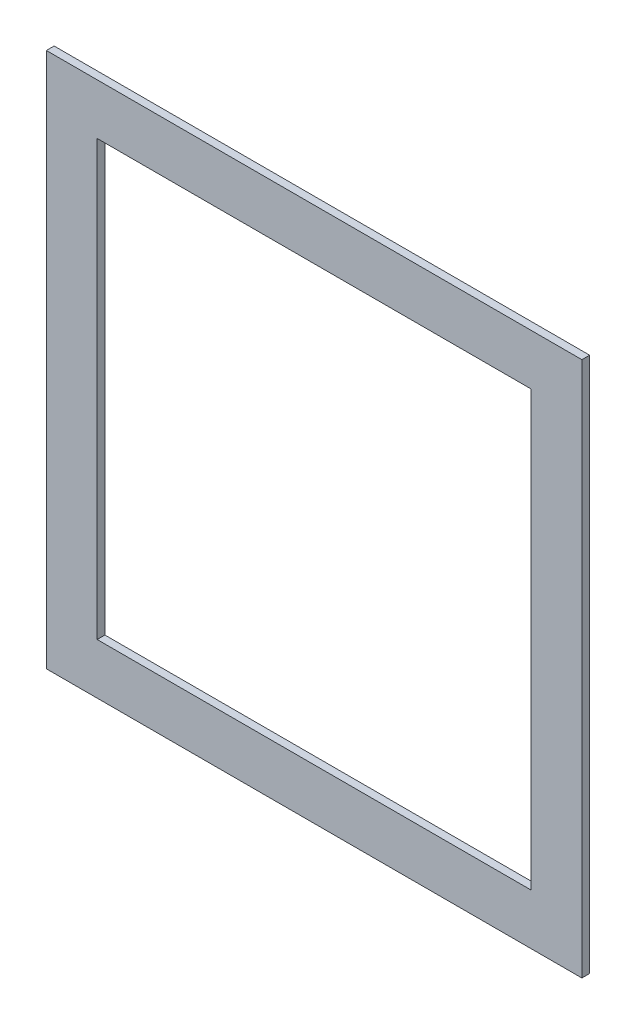
ISO-10303-21;
HEADER;
FILE_DESCRIPTION(('STEP AP214'),'2;1');
FILE_NAME('part.step','',(''),(''),'','','');
FILE_SCHEMA(('AUTOMOTIVE_DESIGN { 1 0 10303 214 1 1 1 1 }'));
ENDSEC;
DATA;
#1=APPLICATION_CONTEXT('core data for automotive mechanical design processes');
#2=APPLICATION_PROTOCOL_DEFINITION('international standard','automotive_design',2000,#1);
#3=PRODUCT_CONTEXT('',#1,'mechanical');
#4=PRODUCT('Part','Part','',(#3));
#5=PRODUCT_RELATED_PRODUCT_CATEGORY('part','',(#4));
#6=PRODUCT_DEFINITION_FORMATION('','',#4);
#7=PRODUCT_DEFINITION_CONTEXT('part definition',#1,'design');
#8=PRODUCT_DEFINITION('design','',#6,#7);
#9=PRODUCT_DEFINITION_SHAPE('','',#8);
#10=(LENGTH_UNIT() NAMED_UNIT(*) SI_UNIT(.MILLI.,.METRE.));
#11=(NAMED_UNIT(*) PLANE_ANGLE_UNIT() SI_UNIT($,.RADIAN.));
#12=(NAMED_UNIT(*) SI_UNIT($,.STERADIAN.) SOLID_ANGLE_UNIT());
#13=UNCERTAINTY_MEASURE_WITH_UNIT(LENGTH_MEASURE(1.E-05),#10,'distance_accuracy_value','');
#14=(GEOMETRIC_REPRESENTATION_CONTEXT(3) GLOBAL_UNCERTAINTY_ASSIGNED_CONTEXT((#13)) GLOBAL_UNIT_ASSIGNED_CONTEXT((#10,
#11,#12)) REPRESENTATION_CONTEXT('',''));
#15=CARTESIAN_POINT('',(0.,0.,0.));
#16=DIRECTION('',(0.,0.,1.));
#17=DIRECTION('',(1.,0.,0.));
#18=AXIS2_PLACEMENT_3D('',#15,#16,#17);
#19=CARTESIAN_POINT('',(0.,0.,5.334));
#20=DIRECTION('',(0.,0.,-1.));
#21=DIRECTION('',(-1.,0.,0.));
#22=AXIS2_PLACEMENT_3D('',#19,#20,#21);
#23=PLANE('',#22);
#24=DIRECTION('',(0.,1.,0.));
#25=VECTOR('',#24,1.);
#26=CARTESIAN_POINT('',(184.15,-184.15,5.334));
#27=LINE('',#26,#25);
#28=CARTESIAN_POINT('',(184.15,-184.15,5.334));
#29=VERTEX_POINT('',#28);
#30=CARTESIAN_POINT('',(184.15,184.15,5.334));
#31=VERTEX_POINT('',#30);
#32=EDGE_CURVE('E153',#29,#31,#27,.T.);
#33=ORIENTED_EDGE('',*,*,#32,.T.);
#34=DIRECTION('',(-1.,0.,0.));
#35=VECTOR('',#34,1.);
#36=CARTESIAN_POINT('',(-184.15,184.15,5.334));
#37=LINE('',#36,#35);
#38=CARTESIAN_POINT('',(-184.15,184.15,5.334));
#39=VERTEX_POINT('',#38);
#40=EDGE_CURVE('E157',#31,#39,#37,.T.);
#41=ORIENTED_EDGE('',*,*,#40,.T.);
#42=DIRECTION('',(0.,-1.,0.));
#43=VECTOR('',#42,1.);
#44=CARTESIAN_POINT('',(-184.15,-184.15,5.334));
#45=LINE('',#44,#43);
#46=CARTESIAN_POINT('',(-184.15,-184.15,5.334));
#47=VERTEX_POINT('',#46);
#48=EDGE_CURVE('E161',#39,#47,#45,.T.);
#49=ORIENTED_EDGE('',*,*,#48,.T.);
#50=DIRECTION('',(1.,0.,0.));
#51=VECTOR('',#50,1.);
#52=CARTESIAN_POINT('',(-184.15,-184.15,5.334));
#53=LINE('',#52,#51);
#54=EDGE_CURVE('E164',#47,#29,#53,.T.);
#55=ORIENTED_EDGE('',*,*,#54,.T.);
#56=EDGE_LOOP('',(#33,#41,#49,#55));
#57=FACE_BOUND('',#56,.T.);
#58=DIRECTION('',(0.,-1.,0.));
#59=VECTOR('',#58,1.);
#60=CARTESIAN_POINT('',(-149.225,149.225,5.334));
#61=LINE('',#60,#59);
#62=CARTESIAN_POINT('',(-149.225,149.225,5.334));
#63=VERTEX_POINT('',#62);
#64=CARTESIAN_POINT('',(-149.225,-149.225,5.334));
#65=VERTEX_POINT('',#64);
#66=EDGE_CURVE('E105',#63,#65,#61,.T.);
#67=ORIENTED_EDGE('',*,*,#66,.F.);
#68=DIRECTION('',(-1.,0.,0.));
#69=VECTOR('',#68,1.);
#70=CARTESIAN_POINT('',(-149.225,149.225,5.334));
#71=LINE('',#70,#69);
#72=CARTESIAN_POINT('',(149.225,149.225,5.334));
#73=VERTEX_POINT('',#72);
#74=EDGE_CURVE('E131',#73,#63,#71,.T.);
#75=ORIENTED_EDGE('',*,*,#74,.F.);
#76=DIRECTION('',(0.,1.,0.));
#77=VECTOR('',#76,1.);
#78=CARTESIAN_POINT('',(149.225,149.225,5.334));
#79=LINE('',#78,#77);
#80=CARTESIAN_POINT('',(149.225,-149.225,5.334));
#81=VERTEX_POINT('',#80);
#82=EDGE_CURVE('E127',#81,#73,#79,.T.);
#83=ORIENTED_EDGE('',*,*,#82,.F.);
#84=DIRECTION('',(1.,0.,0.));
#85=VECTOR('',#84,1.);
#86=CARTESIAN_POINT('',(-149.225,-149.225,5.334));
#87=LINE('',#86,#85);
#88=EDGE_CURVE('E114',#65,#81,#87,.T.);
#89=ORIENTED_EDGE('',*,*,#88,.F.);
#90=EDGE_LOOP('',(#67,#75,#83,#89));
#91=FACE_BOUND('',#90,.T.);
#92=ADVANCED_FACE('F39',(#57,#91),#23,.F.);
#93=CARTESIAN_POINT('',(0.,0.,0.));
#94=DIRECTION('',(0.,0.,-1.));
#95=DIRECTION('',(-1.,0.,0.));
#96=AXIS2_PLACEMENT_3D('',#93,#94,#95);
#97=PLANE('',#96);
#98=DIRECTION('',(0.,1.,0.));
#99=VECTOR('',#98,1.);
#100=CARTESIAN_POINT('',(184.15,-184.15,0.));
#101=LINE('',#100,#99);
#102=CARTESIAN_POINT('',(184.15,-184.15,0.));
#103=VERTEX_POINT('',#102);
#104=CARTESIAN_POINT('',(184.15,184.15,0.));
#105=VERTEX_POINT('',#104);
#106=EDGE_CURVE('E123',#103,#105,#101,.T.);
#107=ORIENTED_EDGE('',*,*,#106,.F.);
#108=DIRECTION('',(1.,0.,0.));
#109=VECTOR('',#108,1.);
#110=CARTESIAN_POINT('',(-184.15,-184.15,0.));
#111=LINE('',#110,#109);
#112=CARTESIAN_POINT('',(-184.15,-184.15,0.));
#113=VERTEX_POINT('',#112);
#114=EDGE_CURVE('E158',#113,#103,#111,.T.);
#115=ORIENTED_EDGE('',*,*,#114,.F.);
#116=DIRECTION('',(0.,-1.,0.));
#117=VECTOR('',#116,1.);
#118=CARTESIAN_POINT('',(-184.15,-184.15,0.));
#119=LINE('',#118,#117);
#120=CARTESIAN_POINT('',(-184.15,184.15,0.));
#121=VERTEX_POINT('',#120);
#122=EDGE_CURVE('E174',#121,#113,#119,.T.);
#123=ORIENTED_EDGE('',*,*,#122,.F.);
#124=DIRECTION('',(-1.,0.,0.));
#125=VECTOR('',#124,1.);
#126=CARTESIAN_POINT('',(-184.15,184.15,0.));
#127=LINE('',#126,#125);
#128=EDGE_CURVE('E171',#105,#121,#127,.T.);
#129=ORIENTED_EDGE('',*,*,#128,.F.);
#130=EDGE_LOOP('',(#107,#115,#123,#129));
#131=FACE_BOUND('',#130,.T.);
#132=DIRECTION('',(-1.,0.,0.));
#133=VECTOR('',#132,1.);
#134=CARTESIAN_POINT('',(-149.225,149.225,0.));
#135=LINE('',#134,#133);
#136=CARTESIAN_POINT('',(149.225,149.225,0.));
#137=VERTEX_POINT('',#136);
#138=CARTESIAN_POINT('',(-149.225,149.225,0.));
#139=VERTEX_POINT('',#138);
#140=EDGE_CURVE('E115',#137,#139,#135,.T.);
#141=ORIENTED_EDGE('',*,*,#140,.T.);
#142=DIRECTION('',(0.,-1.,0.));
#143=VECTOR('',#142,1.);
#144=CARTESIAN_POINT('',(-149.225,149.225,0.));
#145=LINE('',#144,#143);
#146=CARTESIAN_POINT('',(-149.225,-149.225,0.));
#147=VERTEX_POINT('',#146);
#148=EDGE_CURVE('E63',#139,#147,#145,.T.);
#149=ORIENTED_EDGE('',*,*,#148,.T.);
#150=DIRECTION('',(1.,0.,0.));
#151=VECTOR('',#150,1.);
#152=CARTESIAN_POINT('',(-149.225,-149.225,0.));
#153=LINE('',#152,#151);
#154=CARTESIAN_POINT('',(149.225,-149.225,0.));
#155=VERTEX_POINT('',#154);
#156=EDGE_CURVE('E121',#147,#155,#153,.T.);
#157=ORIENTED_EDGE('',*,*,#156,.T.);
#158=DIRECTION('',(0.,1.,0.));
#159=VECTOR('',#158,1.);
#160=CARTESIAN_POINT('',(149.225,149.225,0.));
#161=LINE('',#160,#159);
#162=EDGE_CURVE('E140',#155,#137,#161,.T.);
#163=ORIENTED_EDGE('',*,*,#162,.T.);
#164=EDGE_LOOP('',(#141,#149,#157,#163));
#165=FACE_BOUND('',#164,.T.);
#166=ADVANCED_FACE('F197',(#131,#165),#97,.T.);
#167=CARTESIAN_POINT('',(184.15,-184.15,5.334));
#168=DIRECTION('',(-1.,0.,0.));
#169=DIRECTION('',(0.,0.,1.));
#170=AXIS2_PLACEMENT_3D('',#167,#168,#169);
#171=PLANE('',#170);
#172=ORIENTED_EDGE('',*,*,#106,.T.);
#173=DIRECTION('',(0.,0.,-1.));
#174=VECTOR('',#173,1.);
#175=CARTESIAN_POINT('',(184.15,184.15,5.334));
#176=LINE('',#175,#174);
#177=EDGE_CURVE('E11',#31,#105,#176,.T.);
#178=ORIENTED_EDGE('',*,*,#177,.F.);
#179=ORIENTED_EDGE('',*,*,#32,.F.);
#180=DIRECTION('',(0.,0.,-1.));
#181=VECTOR('',#180,1.);
#182=CARTESIAN_POINT('',(184.15,-184.15,5.334));
#183=LINE('',#182,#181);
#184=EDGE_CURVE('E167',#29,#103,#183,.T.);
#185=ORIENTED_EDGE('',*,*,#184,.T.);
#186=EDGE_LOOP('',(#172,#178,#179,#185));
#187=FACE_BOUND('',#186,.T.);
#188=ADVANCED_FACE('F41',(#187),#171,.F.);
#189=CARTESIAN_POINT('',(-184.15,184.15,5.334));
#190=DIRECTION('',(0.,-1.,0.));
#191=DIRECTION('',(0.,0.,-1.));
#192=AXIS2_PLACEMENT_3D('',#189,#190,#191);
#193=PLANE('',#192);
#194=ORIENTED_EDGE('',*,*,#128,.T.);
#195=DIRECTION('',(0.,0.,-1.));
#196=VECTOR('',#195,1.);
#197=CARTESIAN_POINT('',(-184.15,184.15,5.334));
#198=LINE('',#197,#196);
#199=EDGE_CURVE('E48',#39,#121,#198,.T.);
#200=ORIENTED_EDGE('',*,*,#199,.F.);
#201=ORIENTED_EDGE('',*,*,#40,.F.);
#202=ORIENTED_EDGE('',*,*,#177,.T.);
#203=EDGE_LOOP('',(#194,#200,#201,#202));
#204=FACE_BOUND('',#203,.T.);
#205=ADVANCED_FACE('F207',(#204),#193,.F.);
#206=CARTESIAN_POINT('',(-184.15,-184.15,5.334));
#207=DIRECTION('',(1.,0.,0.));
#208=DIRECTION('',(0.,0.,-1.));
#209=AXIS2_PLACEMENT_3D('',#206,#207,#208);
#210=PLANE('',#209);
#211=ORIENTED_EDGE('',*,*,#122,.T.);
#212=DIRECTION('',(0.,0.,-1.));
#213=VECTOR('',#212,1.);
#214=CARTESIAN_POINT('',(-184.15,-184.15,5.334));
#215=LINE('',#214,#213);
#216=EDGE_CURVE('E182',#47,#113,#215,.T.);
#217=ORIENTED_EDGE('',*,*,#216,.F.);
#218=ORIENTED_EDGE('',*,*,#48,.F.);
#219=ORIENTED_EDGE('',*,*,#199,.T.);
#220=EDGE_LOOP('',(#211,#217,#218,#219));
#221=FACE_BOUND('',#220,.T.);
#222=ADVANCED_FACE('F191',(#221),#210,.F.);
#223=CARTESIAN_POINT('',(-184.15,-184.15,5.334));
#224=DIRECTION('',(0.,1.,0.));
#225=DIRECTION('',(0.,0.,1.));
#226=AXIS2_PLACEMENT_3D('',#223,#224,#225);
#227=PLANE('',#226);
#228=ORIENTED_EDGE('',*,*,#114,.T.);
#229=ORIENTED_EDGE('',*,*,#184,.F.);
#230=ORIENTED_EDGE('',*,*,#54,.F.);
#231=ORIENTED_EDGE('',*,*,#216,.T.);
#232=EDGE_LOOP('',(#228,#229,#230,#231));
#233=FACE_BOUND('',#232,.T.);
#234=ADVANCED_FACE('F201',(#233),#227,.F.);
#235=CARTESIAN_POINT('',(-149.225,149.225,5.334));
#236=DIRECTION('',(1.,0.,0.));
#237=DIRECTION('',(0.,0.,-1.));
#238=AXIS2_PLACEMENT_3D('',#235,#236,#237);
#239=PLANE('',#238);
#240=ORIENTED_EDGE('',*,*,#148,.F.);
#241=DIRECTION('',(0.,0.,-1.));
#242=VECTOR('',#241,1.);
#243=CARTESIAN_POINT('',(-149.225,149.225,5.334));
#244=LINE('',#243,#242);
#245=EDGE_CURVE('E109',#63,#139,#244,.T.);
#246=ORIENTED_EDGE('',*,*,#245,.F.);
#247=ORIENTED_EDGE('',*,*,#66,.T.);
#248=DIRECTION('',(0.,0.,-1.));
#249=VECTOR('',#248,1.);
#250=CARTESIAN_POINT('',(-149.225,-149.225,5.334));
#251=LINE('',#250,#249);
#252=EDGE_CURVE('E108',#65,#147,#251,.T.);
#253=ORIENTED_EDGE('',*,*,#252,.T.);
#254=EDGE_LOOP('',(#240,#246,#247,#253));
#255=FACE_BOUND('',#254,.T.);
#256=ADVANCED_FACE('F107',(#255),#239,.T.);
#257=CARTESIAN_POINT('',(-149.225,-149.225,5.334));
#258=DIRECTION('',(0.,1.,0.));
#259=DIRECTION('',(0.,0.,1.));
#260=AXIS2_PLACEMENT_3D('',#257,#258,#259);
#261=PLANE('',#260);
#262=ORIENTED_EDGE('',*,*,#156,.F.);
#263=ORIENTED_EDGE('',*,*,#252,.F.);
#264=ORIENTED_EDGE('',*,*,#88,.T.);
#265=DIRECTION('',(0.,0.,-1.));
#266=VECTOR('',#265,1.);
#267=CARTESIAN_POINT('',(149.225,-149.225,5.334));
#268=LINE('',#267,#266);
#269=EDGE_CURVE('E124',#81,#155,#268,.T.);
#270=ORIENTED_EDGE('',*,*,#269,.T.);
#271=EDGE_LOOP('',(#262,#263,#264,#270));
#272=FACE_BOUND('',#271,.T.);
#273=ADVANCED_FACE('F118',(#272),#261,.T.);
#274=CARTESIAN_POINT('',(149.225,149.225,5.334));
#275=DIRECTION('',(-1.,0.,0.));
#276=DIRECTION('',(0.,-1.,0.));
#277=AXIS2_PLACEMENT_3D('',#274,#275,#276);
#278=PLANE('',#277);
#279=ORIENTED_EDGE('',*,*,#162,.F.);
#280=ORIENTED_EDGE('',*,*,#269,.F.);
#281=ORIENTED_EDGE('',*,*,#82,.T.);
#282=DIRECTION('',(0.,0.,-1.));
#283=VECTOR('',#282,1.);
#284=CARTESIAN_POINT('',(149.225,149.225,5.334));
#285=LINE('',#284,#283);
#286=EDGE_CURVE('E55',#73,#137,#285,.T.);
#287=ORIENTED_EDGE('',*,*,#286,.T.);
#288=EDGE_LOOP('',(#279,#280,#281,#287));
#289=FACE_BOUND('',#288,.T.);
#290=ADVANCED_FACE('F230',(#289),#278,.T.);
#291=CARTESIAN_POINT('',(-149.225,149.225,5.334));
#292=DIRECTION('',(0.,-1.,0.));
#293=DIRECTION('',(0.,0.,-1.));
#294=AXIS2_PLACEMENT_3D('',#291,#292,#293);
#295=PLANE('',#294);
#296=ORIENTED_EDGE('',*,*,#140,.F.);
#297=ORIENTED_EDGE('',*,*,#286,.F.);
#298=ORIENTED_EDGE('',*,*,#74,.T.);
#299=ORIENTED_EDGE('',*,*,#245,.T.);
#300=EDGE_LOOP('',(#296,#297,#298,#299));
#301=FACE_BOUND('',#300,.T.);
#302=ADVANCED_FACE('F234',(#301),#295,.T.);
#303=CLOSED_SHELL('',(#92,#166,#188,#205,#222,#234,#256,#273,#290,#302));
#304=MANIFOLD_SOLID_BREP('B2',#303);
#305=ADVANCED_BREP_SHAPE_REPRESENTATION('',(#18,#304),#14);
#306=SHAPE_DEFINITION_REPRESENTATION(#9,#305);
ENDSEC;
END-ISO-10303-21;
